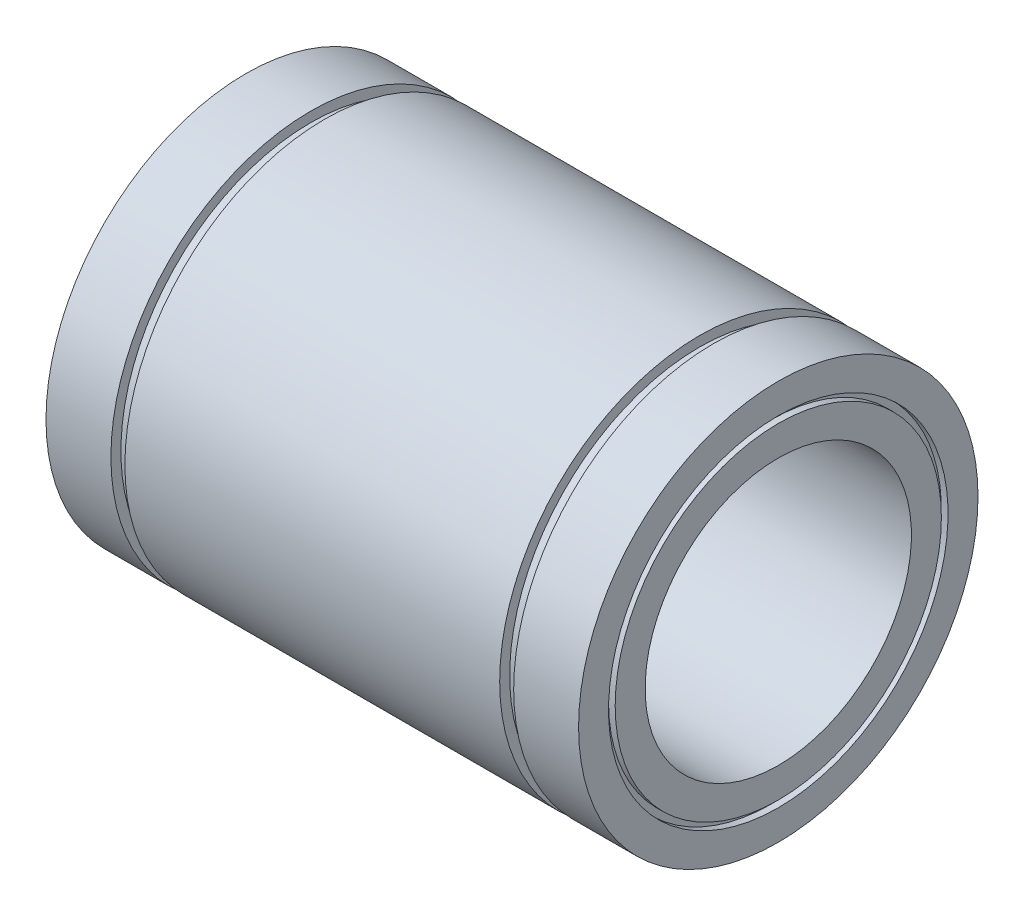
ISO-10303-21;
HEADER;
FILE_DESCRIPTION(('STEP AP214'),'2;1');
FILE_NAME('part.step','',(''),(''),'','','');
FILE_SCHEMA(('AUTOMOTIVE_DESIGN { 1 0 10303 214 1 1 1 1 }'));
ENDSEC;
DATA;
#1=APPLICATION_CONTEXT('core data for automotive mechanical design processes');
#2=APPLICATION_PROTOCOL_DEFINITION('international standard','automotive_design',2000,#1);
#3=PRODUCT_CONTEXT('',#1,'mechanical');
#4=PRODUCT('Part','Part','',(#3));
#5=PRODUCT_RELATED_PRODUCT_CATEGORY('part','',(#4));
#6=PRODUCT_DEFINITION_FORMATION('','',#4);
#7=PRODUCT_DEFINITION_CONTEXT('part definition',#1,'design');
#8=PRODUCT_DEFINITION('design','',#6,#7);
#9=PRODUCT_DEFINITION_SHAPE('','',#8);
#10=(LENGTH_UNIT() NAMED_UNIT(*) SI_UNIT(.MILLI.,.METRE.));
#11=(NAMED_UNIT(*) PLANE_ANGLE_UNIT() SI_UNIT($,.RADIAN.));
#12=(NAMED_UNIT(*) SI_UNIT($,.STERADIAN.) SOLID_ANGLE_UNIT());
#13=UNCERTAINTY_MEASURE_WITH_UNIT(LENGTH_MEASURE(1.E-05),#10,'distance_accuracy_value','');
#14=(GEOMETRIC_REPRESENTATION_CONTEXT(3) GLOBAL_UNCERTAINTY_ASSIGNED_CONTEXT((#13)) GLOBAL_UNIT_ASSIGNED_CONTEXT((#10,
#11,#12)) REPRESENTATION_CONTEXT('',''));
#15=CARTESIAN_POINT('',(0.,0.,0.));
#16=DIRECTION('',(0.,0.,1.));
#17=DIRECTION('',(1.,0.,0.));
#18=AXIS2_PLACEMENT_3D('',#15,#16,#17);
#19=CARTESIAN_POINT('',(-40.,25.5,0.));
#20=DIRECTION('',(-1.,0.,0.));
#21=DIRECTION('',(0.,-1.,0.));
#22=AXIS2_PLACEMENT_3D('',#19,#20,#21);
#23=PLANE('',#22);
#24=CARTESIAN_POINT('',(-40.,0.,0.));
#25=DIRECTION('',(1.,0.,0.));
#26=DIRECTION('',(0.,1.,0.));
#27=AXIS2_PLACEMENT_3D('',#24,#25,#26);
#28=CIRCLE('',#27,25.5);
#29=CARTESIAN_POINT('',(-40.,25.5,0.));
#30=VERTEX_POINT('',#29);
#31=EDGE_CURVE('E121',#30,#30,#28,.T.);
#32=ORIENTED_EDGE('',*,*,#31,.T.);
#33=EDGE_LOOP('',(#32));
#34=FACE_BOUND('',#33,.T.);
#35=CARTESIAN_POINT('',(-40.,0.,0.));
#36=DIRECTION('',(1.,0.,0.));
#37=DIRECTION('',(0.,1.,0.));
#38=AXIS2_PLACEMENT_3D('',#35,#36,#37);
#39=CIRCLE('',#38,30.);
#40=CARTESIAN_POINT('',(-40.,30.,0.));
#41=VERTEX_POINT('',#40);
#42=EDGE_CURVE('E10',#41,#41,#39,.T.);
#43=ORIENTED_EDGE('',*,*,#42,.F.);
#44=EDGE_LOOP('',(#43));
#45=FACE_BOUND('',#44,.T.);
#46=ADVANCED_FACE('F38',(#34,#45),#23,.T.);
#47=CARTESIAN_POINT('',(0.,0.,0.));
#48=DIRECTION('',(1.,0.,0.));
#49=DIRECTION('',(0.,1.,0.));
#50=AXIS2_PLACEMENT_3D('',#47,#48,#49);
#51=CYLINDRICAL_SURFACE('',#50,30.);
#52=ORIENTED_EDGE('',*,*,#42,.T.);
#53=EDGE_LOOP('',(#52));
#54=FACE_BOUND('',#53,.T.);
#55=CARTESIAN_POINT('',(-30.25,0.,0.));
#56=DIRECTION('',(1.,0.,0.));
#57=DIRECTION('',(0.,1.,0.));
#58=AXIS2_PLACEMENT_3D('',#55,#56,#57);
#59=CIRCLE('',#58,30.);
#60=CARTESIAN_POINT('',(-30.25,30.,0.));
#61=VERTEX_POINT('',#60);
#62=EDGE_CURVE('E45',#61,#61,#59,.T.);
#63=ORIENTED_EDGE('',*,*,#62,.F.);
#64=EDGE_LOOP('',(#63));
#65=FACE_BOUND('',#64,.T.);
#66=ADVANCED_FACE('F140',(#54,#65),#51,.T.);
#67=CARTESIAN_POINT('',(-30.25,30.,0.));
#68=DIRECTION('',(1.,0.,0.));
#69=DIRECTION('',(0.,1.,0.));
#70=AXIS2_PLACEMENT_3D('',#67,#68,#69);
#71=PLANE('',#70);
#72=ORIENTED_EDGE('',*,*,#62,.T.);
#73=EDGE_LOOP('',(#72));
#74=FACE_BOUND('',#73,.T.);
#75=CARTESIAN_POINT('',(-30.25,0.,0.));
#76=DIRECTION('',(1.,0.,0.));
#77=DIRECTION('',(0.,1.,0.));
#78=AXIS2_PLACEMENT_3D('',#75,#76,#77);
#79=CIRCLE('',#78,28.5);
#80=CARTESIAN_POINT('',(-30.25,28.5,0.));
#81=VERTEX_POINT('',#80);
#82=EDGE_CURVE('E52',#81,#81,#79,.T.);
#83=ORIENTED_EDGE('',*,*,#82,.F.);
#84=EDGE_LOOP('',(#83));
#85=FACE_BOUND('',#84,.T.);
#86=ADVANCED_FACE('F144',(#74,#85),#71,.T.);
#87=CARTESIAN_POINT('',(0.,0.,0.));
#88=DIRECTION('',(1.,0.,0.));
#89=DIRECTION('',(0.,1.,0.));
#90=AXIS2_PLACEMENT_3D('',#87,#88,#89);
#91=CYLINDRICAL_SURFACE('',#90,28.5);
#92=ORIENTED_EDGE('',*,*,#82,.T.);
#93=EDGE_LOOP('',(#92));
#94=FACE_BOUND('',#93,.T.);
#95=CARTESIAN_POINT('',(-28.15,0.,0.));
#96=DIRECTION('',(1.,0.,0.));
#97=DIRECTION('',(0.,1.,0.));
#98=AXIS2_PLACEMENT_3D('',#95,#96,#97);
#99=CIRCLE('',#98,28.5);
#100=CARTESIAN_POINT('',(-28.15,28.5,0.));
#101=VERTEX_POINT('',#100);
#102=EDGE_CURVE('E59',#101,#101,#99,.T.);
#103=ORIENTED_EDGE('',*,*,#102,.F.);
#104=EDGE_LOOP('',(#103));
#105=FACE_BOUND('',#104,.T.);
#106=ADVANCED_FACE('F148',(#94,#105),#91,.T.);
#107=CARTESIAN_POINT('',(-28.15,28.5,0.));
#108=DIRECTION('',(-1.,0.,0.));
#109=DIRECTION('',(0.,-1.,0.));
#110=AXIS2_PLACEMENT_3D('',#107,#108,#109);
#111=PLANE('',#110);
#112=ORIENTED_EDGE('',*,*,#102,.T.);
#113=EDGE_LOOP('',(#112));
#114=FACE_BOUND('',#113,.T.);
#115=CARTESIAN_POINT('',(-28.15,0.,0.));
#116=DIRECTION('',(1.,0.,0.));
#117=DIRECTION('',(0.,1.,0.));
#118=AXIS2_PLACEMENT_3D('',#115,#116,#117);
#119=CIRCLE('',#118,30.);
#120=CARTESIAN_POINT('',(-28.15,30.,0.));
#121=VERTEX_POINT('',#120);
#122=EDGE_CURVE('E65',#121,#121,#119,.T.);
#123=ORIENTED_EDGE('',*,*,#122,.F.);
#124=EDGE_LOOP('',(#123));
#125=FACE_BOUND('',#124,.T.);
#126=ADVANCED_FACE('F154',(#114,#125),#111,.T.);
#127=CARTESIAN_POINT('',(0.,0.,0.));
#128=DIRECTION('',(1.,0.,0.));
#129=DIRECTION('',(0.,1.,0.));
#130=AXIS2_PLACEMENT_3D('',#127,#128,#129);
#131=CYLINDRICAL_SURFACE('',#130,30.);
#132=ORIENTED_EDGE('',*,*,#122,.T.);
#133=EDGE_LOOP('',(#132));
#134=FACE_BOUND('',#133,.T.);
#135=CARTESIAN_POINT('',(28.15,0.,0.));
#136=DIRECTION('',(1.,0.,0.));
#137=DIRECTION('',(0.,1.,0.));
#138=AXIS2_PLACEMENT_3D('',#135,#136,#137);
#139=CIRCLE('',#138,30.);
#140=CARTESIAN_POINT('',(28.15,30.,0.));
#141=VERTEX_POINT('',#140);
#142=EDGE_CURVE('E69',#141,#141,#139,.T.);
#143=ORIENTED_EDGE('',*,*,#142,.F.);
#144=EDGE_LOOP('',(#143));
#145=FACE_BOUND('',#144,.T.);
#146=ADVANCED_FACE('F158',(#134,#145),#131,.T.);
#147=CARTESIAN_POINT('',(28.15,30.,0.));
#148=DIRECTION('',(1.,0.,0.));
#149=DIRECTION('',(0.,1.,0.));
#150=AXIS2_PLACEMENT_3D('',#147,#148,#149);
#151=PLANE('',#150);
#152=ORIENTED_EDGE('',*,*,#142,.T.);
#153=EDGE_LOOP('',(#152));
#154=FACE_BOUND('',#153,.T.);
#155=CARTESIAN_POINT('',(28.15,0.,0.));
#156=DIRECTION('',(1.,0.,0.));
#157=DIRECTION('',(0.,1.,0.));
#158=AXIS2_PLACEMENT_3D('',#155,#156,#157);
#159=CIRCLE('',#158,28.5);
#160=CARTESIAN_POINT('',(28.15,28.5,0.));
#161=VERTEX_POINT('',#160);
#162=EDGE_CURVE('E73',#161,#161,#159,.T.);
#163=ORIENTED_EDGE('',*,*,#162,.F.);
#164=EDGE_LOOP('',(#163));
#165=FACE_BOUND('',#164,.T.);
#166=ADVANCED_FACE('F162',(#154,#165),#151,.T.);
#167=CARTESIAN_POINT('',(0.,0.,0.));
#168=DIRECTION('',(1.,0.,0.));
#169=DIRECTION('',(0.,1.,0.));
#170=AXIS2_PLACEMENT_3D('',#167,#168,#169);
#171=CYLINDRICAL_SURFACE('',#170,28.5);
#172=ORIENTED_EDGE('',*,*,#162,.T.);
#173=EDGE_LOOP('',(#172));
#174=FACE_BOUND('',#173,.T.);
#175=CARTESIAN_POINT('',(30.25,0.,0.));
#176=DIRECTION('',(1.,0.,0.));
#177=DIRECTION('',(0.,1.,0.));
#178=AXIS2_PLACEMENT_3D('',#175,#176,#177);
#179=CIRCLE('',#178,28.5);
#180=CARTESIAN_POINT('',(30.25,28.5,0.));
#181=VERTEX_POINT('',#180);
#182=EDGE_CURVE('E76',#181,#181,#179,.T.);
#183=ORIENTED_EDGE('',*,*,#182,.F.);
#184=EDGE_LOOP('',(#183));
#185=FACE_BOUND('',#184,.T.);
#186=ADVANCED_FACE('F166',(#174,#185),#171,.T.);
#187=CARTESIAN_POINT('',(30.25,28.5,0.));
#188=DIRECTION('',(-1.,0.,0.));
#189=DIRECTION('',(0.,-1.,0.));
#190=AXIS2_PLACEMENT_3D('',#187,#188,#189);
#191=PLANE('',#190);
#192=ORIENTED_EDGE('',*,*,#182,.T.);
#193=EDGE_LOOP('',(#192));
#194=FACE_BOUND('',#193,.T.);
#195=CARTESIAN_POINT('',(30.25,0.,0.));
#196=DIRECTION('',(1.,0.,0.));
#197=DIRECTION('',(0.,1.,0.));
#198=AXIS2_PLACEMENT_3D('',#195,#196,#197);
#199=CIRCLE('',#198,30.);
#200=CARTESIAN_POINT('',(30.25,30.,0.));
#201=VERTEX_POINT('',#200);
#202=EDGE_CURVE('E80',#201,#201,#199,.T.);
#203=ORIENTED_EDGE('',*,*,#202,.F.);
#204=EDGE_LOOP('',(#203));
#205=FACE_BOUND('',#204,.T.);
#206=ADVANCED_FACE('F170',(#194,#205),#191,.T.);
#207=CARTESIAN_POINT('',(0.,0.,0.));
#208=DIRECTION('',(1.,0.,0.));
#209=DIRECTION('',(0.,1.,0.));
#210=AXIS2_PLACEMENT_3D('',#207,#208,#209);
#211=CYLINDRICAL_SURFACE('',#210,29.9999999999999);
#212=ORIENTED_EDGE('',*,*,#202,.T.);
#213=EDGE_LOOP('',(#212));
#214=FACE_BOUND('',#213,.T.);
#215=CARTESIAN_POINT('',(40.,0.,0.));
#216=DIRECTION('',(1.,0.,0.));
#217=DIRECTION('',(0.,1.,0.));
#218=AXIS2_PLACEMENT_3D('',#215,#216,#217);
#219=CIRCLE('',#218,29.9999999999999);
#220=CARTESIAN_POINT('',(40.,29.9999999999999,0.));
#221=VERTEX_POINT('',#220);
#222=EDGE_CURVE('E84',#221,#221,#219,.T.);
#223=ORIENTED_EDGE('',*,*,#222,.F.);
#224=EDGE_LOOP('',(#223));
#225=FACE_BOUND('',#224,.T.);
#226=ADVANCED_FACE('F174',(#214,#225),#211,.T.);
#227=CARTESIAN_POINT('',(40.,29.9999999999999,0.));
#228=DIRECTION('',(1.,0.,0.));
#229=DIRECTION('',(0.,1.,0.));
#230=AXIS2_PLACEMENT_3D('',#227,#228,#229);
#231=PLANE('',#230);
#232=ORIENTED_EDGE('',*,*,#222,.T.);
#233=EDGE_LOOP('',(#232));
#234=FACE_BOUND('',#233,.T.);
#235=CARTESIAN_POINT('',(40.,0.,0.));
#236=DIRECTION('',(1.,0.,0.));
#237=DIRECTION('',(0.,1.,0.));
#238=AXIS2_PLACEMENT_3D('',#235,#236,#237);
#239=CIRCLE('',#238,25.4999999999999);
#240=CARTESIAN_POINT('',(40.,25.4999999999999,0.));
#241=VERTEX_POINT('',#240);
#242=EDGE_CURVE('E87',#241,#241,#239,.T.);
#243=ORIENTED_EDGE('',*,*,#242,.F.);
#244=EDGE_LOOP('',(#243));
#245=FACE_BOUND('',#244,.T.);
#246=ADVANCED_FACE('F178',(#234,#245),#231,.T.);
#247=CARTESIAN_POINT('',(0.,0.,0.));
#248=DIRECTION('',(1.,0.,0.));
#249=DIRECTION('',(0.,1.,0.));
#250=AXIS2_PLACEMENT_3D('',#247,#248,#249);
#251=CYLINDRICAL_SURFACE('',#250,25.4999999999999);
#252=ORIENTED_EDGE('',*,*,#242,.T.);
#253=EDGE_LOOP('',(#252));
#254=FACE_BOUND('',#253,.T.);
#255=CARTESIAN_POINT('',(39.,0.,0.));
#256=DIRECTION('',(1.,0.,0.));
#257=DIRECTION('',(0.,1.,0.));
#258=AXIS2_PLACEMENT_3D('',#255,#256,#257);
#259=CIRCLE('',#258,25.4999999999999);
#260=CARTESIAN_POINT('',(39.,25.4999999999999,0.));
#261=VERTEX_POINT('',#260);
#262=EDGE_CURVE('E91',#261,#261,#259,.T.);
#263=ORIENTED_EDGE('',*,*,#262,.F.);
#264=EDGE_LOOP('',(#263));
#265=FACE_BOUND('',#264,.T.);
#266=ADVANCED_FACE('F182',(#254,#265),#251,.F.);
#267=CARTESIAN_POINT('',(39.,25.4999999999999,0.));
#268=DIRECTION('',(1.,0.,0.));
#269=DIRECTION('',(0.,1.,0.));
#270=AXIS2_PLACEMENT_3D('',#267,#268,#269);
#271=PLANE('',#270);
#272=ORIENTED_EDGE('',*,*,#262,.T.);
#273=EDGE_LOOP('',(#272));
#274=FACE_BOUND('',#273,.T.);
#275=CARTESIAN_POINT('',(39.,0.,0.));
#276=DIRECTION('',(1.,0.,0.));
#277=DIRECTION('',(0.,1.,0.));
#278=AXIS2_PLACEMENT_3D('',#275,#276,#277);
#279=CIRCLE('',#278,24.4999999999999);
#280=CARTESIAN_POINT('',(39.,24.4999999999999,0.));
#281=VERTEX_POINT('',#280);
#282=EDGE_CURVE('E95',#281,#281,#279,.T.);
#283=ORIENTED_EDGE('',*,*,#282,.F.);
#284=EDGE_LOOP('',(#283));
#285=FACE_BOUND('',#284,.T.);
#286=ADVANCED_FACE('F186',(#274,#285),#271,.T.);
#287=CARTESIAN_POINT('',(0.,0.,0.));
#288=DIRECTION('',(1.,0.,0.));
#289=DIRECTION('',(0.,1.,0.));
#290=AXIS2_PLACEMENT_3D('',#287,#288,#289);
#291=CYLINDRICAL_SURFACE('',#290,24.4999999999999);
#292=ORIENTED_EDGE('',*,*,#282,.T.);
#293=EDGE_LOOP('',(#292));
#294=FACE_BOUND('',#293,.T.);
#295=CARTESIAN_POINT('',(40.,0.,0.));
#296=DIRECTION('',(1.,0.,0.));
#297=DIRECTION('',(0.,1.,0.));
#298=AXIS2_PLACEMENT_3D('',#295,#296,#297);
#299=CIRCLE('',#298,24.4999999999999);
#300=CARTESIAN_POINT('',(40.,24.4999999999999,0.));
#301=VERTEX_POINT('',#300);
#302=EDGE_CURVE('E99',#301,#301,#299,.T.);
#303=ORIENTED_EDGE('',*,*,#302,.F.);
#304=EDGE_LOOP('',(#303));
#305=FACE_BOUND('',#304,.T.);
#306=ADVANCED_FACE('F190',(#294,#305),#291,.T.);
#307=CARTESIAN_POINT('',(40.,24.4999999999999,0.));
#308=DIRECTION('',(1.,0.,0.));
#309=DIRECTION('',(0.,1.,0.));
#310=AXIS2_PLACEMENT_3D('',#307,#308,#309);
#311=PLANE('',#310);
#312=ORIENTED_EDGE('',*,*,#302,.T.);
#313=EDGE_LOOP('',(#312));
#314=FACE_BOUND('',#313,.T.);
#315=CARTESIAN_POINT('',(40.,0.,0.));
#316=DIRECTION('',(1.,0.,0.));
#317=DIRECTION('',(0.,1.,0.));
#318=AXIS2_PLACEMENT_3D('',#315,#316,#317);
#319=CIRCLE('',#318,20.);
#320=CARTESIAN_POINT('',(40.,20.,0.));
#321=VERTEX_POINT('',#320);
#322=EDGE_CURVE('E102',#321,#321,#319,.T.);
#323=ORIENTED_EDGE('',*,*,#322,.F.);
#324=EDGE_LOOP('',(#323));
#325=FACE_BOUND('',#324,.T.);
#326=ADVANCED_FACE('F194',(#314,#325),#311,.T.);
#327=CARTESIAN_POINT('',(0.,0.,0.));
#328=DIRECTION('',(1.,0.,0.));
#329=DIRECTION('',(0.,1.,0.));
#330=AXIS2_PLACEMENT_3D('',#327,#328,#329);
#331=CYLINDRICAL_SURFACE('',#330,20.);
#332=ORIENTED_EDGE('',*,*,#322,.T.);
#333=EDGE_LOOP('',(#332));
#334=FACE_BOUND('',#333,.T.);
#335=CARTESIAN_POINT('',(-40.,0.,0.));
#336=DIRECTION('',(1.,0.,0.));
#337=DIRECTION('',(0.,1.,0.));
#338=AXIS2_PLACEMENT_3D('',#335,#336,#337);
#339=CIRCLE('',#338,20.);
#340=CARTESIAN_POINT('',(-40.,20.,0.));
#341=VERTEX_POINT('',#340);
#342=EDGE_CURVE('E106',#341,#341,#339,.T.);
#343=ORIENTED_EDGE('',*,*,#342,.F.);
#344=EDGE_LOOP('',(#343));
#345=FACE_BOUND('',#344,.T.);
#346=ADVANCED_FACE('F198',(#334,#345),#331,.F.);
#347=CARTESIAN_POINT('',(-40.,20.,0.));
#348=DIRECTION('',(-1.,0.,0.));
#349=DIRECTION('',(0.,-1.,0.));
#350=AXIS2_PLACEMENT_3D('',#347,#348,#349);
#351=PLANE('',#350);
#352=ORIENTED_EDGE('',*,*,#342,.T.);
#353=EDGE_LOOP('',(#352));
#354=FACE_BOUND('',#353,.T.);
#355=CARTESIAN_POINT('',(-40.,0.,0.));
#356=DIRECTION('',(1.,0.,0.));
#357=DIRECTION('',(0.,1.,0.));
#358=AXIS2_PLACEMENT_3D('',#355,#356,#357);
#359=CIRCLE('',#358,24.5);
#360=CARTESIAN_POINT('',(-40.,24.5,0.));
#361=VERTEX_POINT('',#360);
#362=EDGE_CURVE('E110',#361,#361,#359,.T.);
#363=ORIENTED_EDGE('',*,*,#362,.F.);
#364=EDGE_LOOP('',(#363));
#365=FACE_BOUND('',#364,.T.);
#366=ADVANCED_FACE('F202',(#354,#365),#351,.T.);
#367=CARTESIAN_POINT('',(0.,0.,0.));
#368=DIRECTION('',(1.,0.,0.));
#369=DIRECTION('',(0.,1.,0.));
#370=AXIS2_PLACEMENT_3D('',#367,#368,#369);
#371=CYLINDRICAL_SURFACE('',#370,24.5);
#372=ORIENTED_EDGE('',*,*,#362,.T.);
#373=EDGE_LOOP('',(#372));
#374=FACE_BOUND('',#373,.T.);
#375=CARTESIAN_POINT('',(-39.,0.,0.));
#376=DIRECTION('',(1.,0.,0.));
#377=DIRECTION('',(0.,1.,0.));
#378=AXIS2_PLACEMENT_3D('',#375,#376,#377);
#379=CIRCLE('',#378,24.5);
#380=CARTESIAN_POINT('',(-39.,24.5,0.));
#381=VERTEX_POINT('',#380);
#382=EDGE_CURVE('E114',#381,#381,#379,.T.);
#383=ORIENTED_EDGE('',*,*,#382,.F.);
#384=EDGE_LOOP('',(#383));
#385=FACE_BOUND('',#384,.T.);
#386=ADVANCED_FACE('F136',(#374,#385),#371,.T.);
#387=CARTESIAN_POINT('',(-39.,25.5,0.));
#388=DIRECTION('',(-1.,0.,0.));
#389=DIRECTION('',(0.,-1.,0.));
#390=AXIS2_PLACEMENT_3D('',#387,#388,#389);
#391=PLANE('',#390);
#392=ORIENTED_EDGE('',*,*,#382,.T.);
#393=EDGE_LOOP('',(#392));
#394=FACE_BOUND('',#393,.T.);
#395=CARTESIAN_POINT('',(-39.,0.,0.));
#396=DIRECTION('',(1.,0.,0.));
#397=DIRECTION('',(0.,1.,0.));
#398=AXIS2_PLACEMENT_3D('',#395,#396,#397);
#399=CIRCLE('',#398,25.5);
#400=CARTESIAN_POINT('',(-39.,25.5,0.));
#401=VERTEX_POINT('',#400);
#402=EDGE_CURVE('E118',#401,#401,#399,.T.);
#403=ORIENTED_EDGE('',*,*,#402,.F.);
#404=EDGE_LOOP('',(#403));
#405=FACE_BOUND('',#404,.T.);
#406=ADVANCED_FACE('F130',(#394,#405),#391,.T.);
#407=CARTESIAN_POINT('',(0.,0.,0.));
#408=DIRECTION('',(1.,0.,0.));
#409=DIRECTION('',(0.,1.,0.));
#410=AXIS2_PLACEMENT_3D('',#407,#408,#409);
#411=CYLINDRICAL_SURFACE('',#410,25.5);
#412=ORIENTED_EDGE('',*,*,#402,.T.);
#413=EDGE_LOOP('',(#412));
#414=FACE_BOUND('',#413,.T.);
#415=ORIENTED_EDGE('',*,*,#31,.F.);
#416=EDGE_LOOP('',(#415));
#417=FACE_BOUND('',#416,.T.);
#418=ADVANCED_FACE('F128',(#414,#417),#411,.F.);
#419=CLOSED_SHELL('',(#46,#66,#86,#106,#126,#146,#166,#186,#206,#226,#246,#266,#286,#306,#326,
#346,#366,#386,#406,#418));
#420=MANIFOLD_SOLID_BREP('B2',#419);
#421=ADVANCED_BREP_SHAPE_REPRESENTATION('',(#18,#420),#14);
#422=SHAPE_DEFINITION_REPRESENTATION(#9,#421);
ENDSEC;
END-ISO-10303-21;
